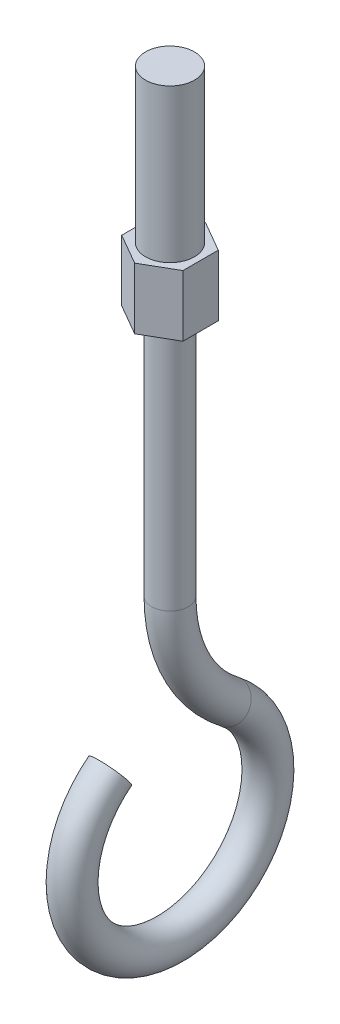
ISO-10303-21;
HEADER;
FILE_DESCRIPTION(('STEP AP214'),'2;1');
FILE_NAME('part.step','',(''),(''),'','','');
FILE_SCHEMA(('AUTOMOTIVE_DESIGN { 1 0 10303 214 1 1 1 1 }'));
ENDSEC;
DATA;
#1=APPLICATION_CONTEXT('core data for automotive mechanical design processes');
#2=APPLICATION_PROTOCOL_DEFINITION('international standard','automotive_design',2000,#1);
#3=PRODUCT_CONTEXT('',#1,'mechanical');
#4=PRODUCT('Part','Part','',(#3));
#5=PRODUCT_RELATED_PRODUCT_CATEGORY('part','',(#4));
#6=PRODUCT_DEFINITION_FORMATION('','',#4);
#7=PRODUCT_DEFINITION_CONTEXT('part definition',#1,'design');
#8=PRODUCT_DEFINITION('design','',#6,#7);
#9=PRODUCT_DEFINITION_SHAPE('','',#8);
#10=(LENGTH_UNIT() NAMED_UNIT(*) SI_UNIT(.MILLI.,.METRE.));
#11=(NAMED_UNIT(*) PLANE_ANGLE_UNIT() SI_UNIT($,.RADIAN.));
#12=(NAMED_UNIT(*) SI_UNIT($,.STERADIAN.) SOLID_ANGLE_UNIT());
#13=UNCERTAINTY_MEASURE_WITH_UNIT(LENGTH_MEASURE(1.E-05),#10,'distance_accuracy_value','');
#14=(GEOMETRIC_REPRESENTATION_CONTEXT(3) GLOBAL_UNCERTAINTY_ASSIGNED_CONTEXT((#13)) GLOBAL_UNIT_ASSIGNED_CONTEXT((#10,
#11,#12)) REPRESENTATION_CONTEXT('',''));
#15=CARTESIAN_POINT('',(0.,0.,0.));
#16=DIRECTION('',(0.,0.,1.));
#17=DIRECTION('',(1.,0.,0.));
#18=AXIS2_PLACEMENT_3D('',#15,#16,#17);
#19=CARTESIAN_POINT('',(0.,-75.9647043265553,12.390243902439));
#20=DIRECTION('',(0.,-0.609756097560976,0.792589112647411));
#21=DIRECTION('',(0.,-0.79258911264741,-0.609756097560977));
#22=AXIS2_PLACEMENT_3D('',#19,#20,#21);
#23=PLANE('',#22);
#24=CARTESIAN_POINT('',(0.,-75.9647043265553,12.390243902439));
#25=DIRECTION('',(0.,-0.609756097560976,0.792589112647411));
#26=DIRECTION('',(0.,-0.79258911264741,-0.609756097560977));
#27=AXIS2_PLACEMENT_3D('',#24,#25,#26);
#28=CIRCLE('',#27,3.81);
#29=CARTESIAN_POINT('',(0.,-78.984468845742,10.0670731707316));
#30=VERTEX_POINT('',#29);
#31=EDGE_CURVE('E10',#30,#30,#28,.T.);
#32=ORIENTED_EDGE('',*,*,#31,.F.);
#33=EDGE_LOOP('',(#32));
#34=FACE_BOUND('',#33,.T.);
#35=ADVANCED_FACE('F15',(#34),#23,.F.);
#36=CARTESIAN_POINT('',(0.,0.,0.));
#37=DIRECTION('',(0.,-1.,0.));
#38=DIRECTION('',(0.,0.,-1.));
#39=AXIS2_PLACEMENT_3D('',#36,#37,#38);
#40=CYLINDRICAL_SURFACE('',#39,3.81);
#41=CARTESIAN_POINT('',(0.,-50.8,0.));
#42=DIRECTION('',(0.,1.,0.));
#43=DIRECTION('',(0.,0.,1.));
#44=AXIS2_PLACEMENT_3D('',#41,#42,#43);
#45=CIRCLE('',#44,3.81);
#46=CARTESIAN_POINT('',(0.,-50.8,3.80999999999992));
#47=VERTEX_POINT('',#46);
#48=EDGE_CURVE('E167',#47,#47,#45,.T.);
#49=ORIENTED_EDGE('',*,*,#48,.T.);
#50=EDGE_LOOP('',(#49));
#51=FACE_BOUND('',#50,.T.);
#52=CARTESIAN_POINT('',(0.,0.,0.));
#53=DIRECTION('',(0.,1.,0.));
#54=DIRECTION('',(0.,0.,1.));
#55=AXIS2_PLACEMENT_3D('',#52,#53,#54);
#56=CIRCLE('',#55,3.81);
#57=CARTESIAN_POINT('',(0.,0.,3.81000000000001));
#58=VERTEX_POINT('',#57);
#59=EDGE_CURVE('E163',#58,#58,#56,.T.);
#60=ORIENTED_EDGE('',*,*,#59,.F.);
#61=EDGE_LOOP('',(#60));
#62=FACE_BOUND('',#61,.T.);
#63=ADVANCED_FACE('F191',(#51,#62),#40,.T.);
#64=CARTESIAN_POINT('',(0.,-50.8,-31.7500000000001));
#65=DIRECTION('',(1.,0.,0.));
#66=DIRECTION('',(0.,0.,-1.));
#67=AXIS2_PLACEMENT_3D('',#64,#65,#66);
#68=TOROIDAL_SURFACE('',#67,31.75,3.81);
#69=CARTESIAN_POINT('',(0.,-75.9647043265553,-12.390243902439));
#70=DIRECTION('',(0.,0.609756097560976,0.792589112647411));
#71=DIRECTION('',(0.,-0.792589112647411,0.609756097560977));
#72=AXIS2_PLACEMENT_3D('',#69,#70,#71);
#73=CIRCLE('',#72,3.81);
#74=CARTESIAN_POINT('',(0.,-78.9844688457419,-10.0670731707317));
#75=VERTEX_POINT('',#74);
#76=EDGE_CURVE('E24',#75,#75,#73,.T.);
#77=CARTESIAN_POINT('',(0.,-50.8,-31.7500000000001));
#78=DIRECTION('',(1.,0.,0.));
#79=DIRECTION('',(0.,0.,-1.));
#80=AXIS2_PLACEMENT_3D('',#77,#78,#79);
#81=CIRCLE('',#80,35.56);
#82=EDGE_CURVE('',#47,#75,#81,.T.);
#83=ORIENTED_EDGE('',*,*,#48,.F.);
#84=ORIENTED_EDGE('',*,*,#76,.T.);
#85=ORIENTED_EDGE('',*,*,#82,.T.);
#86=ORIENTED_EDGE('',*,*,#82,.F.);
#87=EDGE_LOOP('',(#83,#85,#84,#86));
#88=FACE_BOUND('',#87,.T.);
#89=ADVANCED_FACE('F177',(#88),#68,.T.);
#90=CARTESIAN_POINT('',(0.,-92.0701150955507,0.));
#91=DIRECTION('',(-1.,0.,0.));
#92=DIRECTION('',(0.,0.,1.));
#93=AXIS2_PLACEMENT_3D('',#90,#91,#92);
#94=TOROIDAL_SURFACE('',#93,20.32,3.81);
#95=ORIENTED_EDGE('',*,*,#31,.T.);
#96=EDGE_LOOP('',(#95));
#97=FACE_BOUND('',#96,.T.);
#98=ORIENTED_EDGE('',*,*,#76,.F.);
#99=EDGE_LOOP('',(#98));
#100=FACE_BOUND('',#99,.T.);
#101=ADVANCED_FACE('F180',(#97,#100),#94,.T.);
#102=CARTESIAN_POINT('',(0.,0.,0.));
#103=DIRECTION('',(0.,1.,0.));
#104=DIRECTION('',(0.,0.,1.));
#105=AXIS2_PLACEMENT_3D('',#102,#103,#104);
#106=PLANE('',#105);
#107=ORIENTED_EDGE('',*,*,#59,.T.);
#108=EDGE_LOOP('',(#107));
#109=FACE_BOUND('',#108,.T.);
#110=DIRECTION('',(0.,0.,-1.));
#111=VECTOR('',#110,1.);
#112=CARTESIAN_POINT('',(6.34999999999999,0.,3.66617420935411));
#113=LINE('',#112,#111);
#114=CARTESIAN_POINT('',(6.34999999999999,0.,3.66617420935411));
#115=VERTEX_POINT('',#114);
#116=CARTESIAN_POINT('',(6.34999999999999,0.,-3.66617420935418));
#117=VERTEX_POINT('',#116);
#118=EDGE_CURVE('E128',#115,#117,#113,.T.);
#119=ORIENTED_EDGE('',*,*,#118,.F.);
#120=DIRECTION('',(0.86602540378444,0.,-0.500000000000001));
#121=VECTOR('',#120,1.);
#122=CARTESIAN_POINT('',(0.,0.,7.33234841870825));
#123=LINE('',#122,#121);
#124=CARTESIAN_POINT('',(0.,0.,7.33234841870825));
#125=VERTEX_POINT('',#124);
#126=EDGE_CURVE('E75',#125,#115,#123,.T.);
#127=ORIENTED_EDGE('',*,*,#126,.F.);
#128=DIRECTION('',(0.866025403784439,0.,0.500000000000001));
#129=VECTOR('',#128,1.);
#130=CARTESIAN_POINT('',(-6.35000000000002,0.,3.6661742093541));
#131=LINE('',#130,#129);
#132=CARTESIAN_POINT('',(-6.35000000000002,0.,3.6661742093541));
#133=VERTEX_POINT('',#132);
#134=EDGE_CURVE('E67',#133,#125,#131,.T.);
#135=ORIENTED_EDGE('',*,*,#134,.F.);
#136=DIRECTION('',(0.,0.,1.));
#137=VECTOR('',#136,1.);
#138=CARTESIAN_POINT('',(-6.35000000000002,0.,-3.66617420935414));
#139=LINE('',#138,#137);
#140=CARTESIAN_POINT('',(-6.35000000000002,0.,-3.66617420935414));
#141=VERTEX_POINT('',#140);
#142=EDGE_CURVE('E112',#141,#133,#139,.T.);
#143=ORIENTED_EDGE('',*,*,#142,.F.);
#144=DIRECTION('',(-0.86602540378444,0.,0.500000000000001));
#145=VECTOR('',#144,1.);
#146=CARTESIAN_POINT('',(0.,0.,-7.33234841870828));
#147=LINE('',#146,#145);
#148=CARTESIAN_POINT('',(0.,0.,-7.33234841870828));
#149=VERTEX_POINT('',#148);
#150=EDGE_CURVE('E136',#149,#141,#147,.T.);
#151=ORIENTED_EDGE('',*,*,#150,.F.);
#152=DIRECTION('',(-0.86602540378444,0.,-0.500000000000001));
#153=VECTOR('',#152,1.);
#154=CARTESIAN_POINT('',(6.34999999999999,0.,-3.66617420935418));
#155=LINE('',#154,#153);
#156=EDGE_CURVE('E132',#117,#149,#155,.T.);
#157=ORIENTED_EDGE('',*,*,#156,.F.);
#158=EDGE_LOOP('',(#119,#127,#135,#143,#151,#157));
#159=FACE_BOUND('',#158,.T.);
#160=ADVANCED_FACE('F182',(#109,#159),#106,.F.);
#161=CARTESIAN_POINT('',(0.,12.7,0.));
#162=DIRECTION('',(0.,1.,0.));
#163=DIRECTION('',(0.,0.,1.));
#164=AXIS2_PLACEMENT_3D('',#161,#162,#163);
#165=PLANE('',#164);
#166=DIRECTION('',(0.,0.,-1.));
#167=VECTOR('',#166,1.);
#168=CARTESIAN_POINT('',(6.34999999999999,12.7,3.66617420935411));
#169=LINE('',#168,#167);
#170=CARTESIAN_POINT('',(6.34999999999999,12.7,3.66617420935411));
#171=VERTEX_POINT('',#170);
#172=CARTESIAN_POINT('',(6.34999999999999,12.7,-3.66617420935418));
#173=VERTEX_POINT('',#172);
#174=EDGE_CURVE('E145',#171,#173,#169,.T.);
#175=ORIENTED_EDGE('',*,*,#174,.T.);
#176=DIRECTION('',(-0.86602540378444,0.,-0.500000000000001));
#177=VECTOR('',#176,1.);
#178=CARTESIAN_POINT('',(6.34999999999999,12.7,-3.66617420935418));
#179=LINE('',#178,#177);
#180=CARTESIAN_POINT('',(0.,12.7,-7.33234841870833));
#181=VERTEX_POINT('',#180);
#182=EDGE_CURVE('E86',#173,#181,#179,.T.);
#183=ORIENTED_EDGE('',*,*,#182,.T.);
#184=DIRECTION('',(-0.86602540378444,0.,0.500000000000001));
#185=VECTOR('',#184,1.);
#186=CARTESIAN_POINT('',(0.,12.7,-7.33234841870833));
#187=LINE('',#186,#185);
#188=CARTESIAN_POINT('',(-6.34999999999999,12.7,-3.66617420935414));
#189=VERTEX_POINT('',#188);
#190=EDGE_CURVE('E103',#181,#189,#187,.T.);
#191=ORIENTED_EDGE('',*,*,#190,.T.);
#192=DIRECTION('',(0.,0.,1.));
#193=VECTOR('',#192,1.);
#194=CARTESIAN_POINT('',(-6.34999999999999,12.7,-3.66617420935414));
#195=LINE('',#194,#193);
#196=CARTESIAN_POINT('',(-6.35000000000002,12.7,3.6661742093541));
#197=VERTEX_POINT('',#196);
#198=EDGE_CURVE('E96',#189,#197,#195,.T.);
#199=ORIENTED_EDGE('',*,*,#198,.T.);
#200=DIRECTION('',(0.866025403784439,0.,0.500000000000001));
#201=VECTOR('',#200,1.);
#202=CARTESIAN_POINT('',(-6.35000000000002,12.7,3.6661742093541));
#203=LINE('',#202,#201);
#204=CARTESIAN_POINT('',(0.,12.7,7.33234841870825));
#205=VERTEX_POINT('',#204);
#206=EDGE_CURVE('E101',#197,#205,#203,.T.);
#207=ORIENTED_EDGE('',*,*,#206,.T.);
#208=DIRECTION('',(0.86602540378444,0.,-0.500000000000001));
#209=VECTOR('',#208,1.);
#210=CARTESIAN_POINT('',(0.,12.7,7.33234841870825));
#211=LINE('',#210,#209);
#212=EDGE_CURVE('E37',#205,#171,#211,.T.);
#213=ORIENTED_EDGE('',*,*,#212,.T.);
#214=EDGE_LOOP('',(#175,#183,#191,#199,#207,#213));
#215=FACE_BOUND('',#214,.T.);
#216=CARTESIAN_POINT('',(0.,12.7,0.));
#217=DIRECTION('',(0.,1.,0.));
#218=DIRECTION('',(0.,0.,1.));
#219=AXIS2_PLACEMENT_3D('',#216,#217,#218);
#220=CIRCLE('',#219,5.08);
#221=CARTESIAN_POINT('',(0.,12.7,5.08000000000001));
#222=VERTEX_POINT('',#221);
#223=EDGE_CURVE('E133',#222,#222,#220,.T.);
#224=ORIENTED_EDGE('',*,*,#223,.F.);
#225=EDGE_LOOP('',(#224));
#226=FACE_BOUND('',#225,.T.);
#227=ADVANCED_FACE('F98',(#215,#226),#165,.T.);
#228=CARTESIAN_POINT('',(6.34999999999999,12.7,3.66617420935411));
#229=DIRECTION('',(-1.,0.,0.));
#230=DIRECTION('',(0.,0.,1.));
#231=AXIS2_PLACEMENT_3D('',#228,#229,#230);
#232=PLANE('',#231);
#233=ORIENTED_EDGE('',*,*,#118,.T.);
#234=DIRECTION('',(0.,-1.,0.));
#235=VECTOR('',#234,1.);
#236=CARTESIAN_POINT('',(6.34999999999999,12.7,-3.66617420935418));
#237=LINE('',#236,#235);
#238=EDGE_CURVE('E156',#173,#117,#237,.T.);
#239=ORIENTED_EDGE('',*,*,#238,.F.);
#240=ORIENTED_EDGE('',*,*,#174,.F.);
#241=DIRECTION('',(0.,-1.,0.));
#242=VECTOR('',#241,1.);
#243=CARTESIAN_POINT('',(6.34999999999999,12.7,3.66617420935411));
#244=LINE('',#243,#242);
#245=EDGE_CURVE('E124',#171,#115,#244,.T.);
#246=ORIENTED_EDGE('',*,*,#245,.T.);
#247=EDGE_LOOP('',(#233,#239,#240,#246));
#248=FACE_BOUND('',#247,.T.);
#249=ADVANCED_FACE('F206',(#248),#232,.F.);
#250=CARTESIAN_POINT('',(6.34999999999999,12.7,-3.66617420935418));
#251=DIRECTION('',(-0.500000000000001,0.,0.86602540378444));
#252=DIRECTION('',(0.86602540378444,0.,0.500000000000001));
#253=AXIS2_PLACEMENT_3D('',#250,#251,#252);
#254=PLANE('',#253);
#255=ORIENTED_EDGE('',*,*,#156,.T.);
#256=DIRECTION('',(0.,-1.,0.));
#257=VECTOR('',#256,1.);
#258=CARTESIAN_POINT('',(0.,12.7,-7.33234841870833));
#259=LINE('',#258,#257);
#260=EDGE_CURVE('E152',#181,#149,#259,.T.);
#261=ORIENTED_EDGE('',*,*,#260,.F.);
#262=ORIENTED_EDGE('',*,*,#182,.F.);
#263=ORIENTED_EDGE('',*,*,#238,.T.);
#264=EDGE_LOOP('',(#255,#261,#262,#263));
#265=FACE_BOUND('',#264,.T.);
#266=ADVANCED_FACE('F209',(#265),#254,.F.);
#267=CARTESIAN_POINT('',(0.,12.7,-7.33234841870833));
#268=DIRECTION('',(0.500000000000001,0.,0.86602540378444));
#269=DIRECTION('',(0.86602540378444,0.,-0.500000000000001));
#270=AXIS2_PLACEMENT_3D('',#267,#268,#269);
#271=PLANE('',#270);
#272=ORIENTED_EDGE('',*,*,#150,.T.);
#273=DIRECTION('',(0.,-1.,0.));
#274=VECTOR('',#273,1.);
#275=CARTESIAN_POINT('',(-6.34999999999999,12.7,-3.66617420935414));
#276=LINE('',#275,#274);
#277=EDGE_CURVE('E114',#189,#141,#276,.T.);
#278=ORIENTED_EDGE('',*,*,#277,.F.);
#279=ORIENTED_EDGE('',*,*,#190,.F.);
#280=ORIENTED_EDGE('',*,*,#260,.T.);
#281=EDGE_LOOP('',(#272,#278,#279,#280));
#282=FACE_BOUND('',#281,.T.);
#283=ADVANCED_FACE('F213',(#282),#271,.F.);
#284=CARTESIAN_POINT('',(-6.34999999999999,12.7,-3.66617420935414));
#285=DIRECTION('',(1.,0.,0.));
#286=DIRECTION('',(0.,0.,-1.));
#287=AXIS2_PLACEMENT_3D('',#284,#285,#286);
#288=PLANE('',#287);
#289=ORIENTED_EDGE('',*,*,#142,.T.);
#290=DIRECTION('',(0.,-1.,0.));
#291=VECTOR('',#290,1.);
#292=CARTESIAN_POINT('',(-6.35000000000002,12.7,3.6661742093541));
#293=LINE('',#292,#291);
#294=EDGE_CURVE('E109',#197,#133,#293,.T.);
#295=ORIENTED_EDGE('',*,*,#294,.F.);
#296=ORIENTED_EDGE('',*,*,#198,.F.);
#297=ORIENTED_EDGE('',*,*,#277,.T.);
#298=EDGE_LOOP('',(#289,#295,#296,#297));
#299=FACE_BOUND('',#298,.T.);
#300=ADVANCED_FACE('F110',(#299),#288,.F.);
#301=CARTESIAN_POINT('',(-6.35000000000002,12.7,3.6661742093541));
#302=DIRECTION('',(0.500000000000001,0.,-0.866025403784439));
#303=DIRECTION('',(-0.86602540378444,0.,-0.500000000000001));
#304=AXIS2_PLACEMENT_3D('',#301,#302,#303);
#305=PLANE('',#304);
#306=ORIENTED_EDGE('',*,*,#134,.T.);
#307=DIRECTION('',(0.,-1.,0.));
#308=VECTOR('',#307,1.);
#309=CARTESIAN_POINT('',(0.,12.7,7.33234841870825));
#310=LINE('',#309,#308);
#311=EDGE_CURVE('E115',#205,#125,#310,.T.);
#312=ORIENTED_EDGE('',*,*,#311,.F.);
#313=ORIENTED_EDGE('',*,*,#206,.F.);
#314=ORIENTED_EDGE('',*,*,#294,.T.);
#315=EDGE_LOOP('',(#306,#312,#313,#314));
#316=FACE_BOUND('',#315,.T.);
#317=ADVANCED_FACE('F117',(#316),#305,.F.);
#318=CARTESIAN_POINT('',(0.,12.7,7.33234841870825));
#319=DIRECTION('',(-0.500000000000001,0.,-0.86602540378444));
#320=DIRECTION('',(-0.86602540378444,0.,0.500000000000001));
#321=AXIS2_PLACEMENT_3D('',#318,#319,#320);
#322=PLANE('',#321);
#323=ORIENTED_EDGE('',*,*,#126,.T.);
#324=ORIENTED_EDGE('',*,*,#245,.F.);
#325=ORIENTED_EDGE('',*,*,#212,.F.);
#326=ORIENTED_EDGE('',*,*,#311,.T.);
#327=EDGE_LOOP('',(#323,#324,#325,#326));
#328=FACE_BOUND('',#327,.T.);
#329=ADVANCED_FACE('F201',(#328),#322,.F.);
#330=CARTESIAN_POINT('',(0.,44.45,0.));
#331=DIRECTION('',(0.,1.,0.));
#332=DIRECTION('',(0.,0.,1.));
#333=AXIS2_PLACEMENT_3D('',#330,#331,#332);
#334=PLANE('',#333);
#335=CARTESIAN_POINT('',(0.,44.45,0.));
#336=DIRECTION('',(0.,1.,0.));
#337=DIRECTION('',(0.,0.,1.));
#338=AXIS2_PLACEMENT_3D('',#335,#336,#337);
#339=CIRCLE('',#338,5.08);
#340=CARTESIAN_POINT('',(0.,44.45,5.08000000000001));
#341=VERTEX_POINT('',#340);
#342=EDGE_CURVE('E159',#341,#341,#339,.T.);
#343=ORIENTED_EDGE('',*,*,#342,.T.);
#344=EDGE_LOOP('',(#343));
#345=FACE_BOUND('',#344,.T.);
#346=ADVANCED_FACE('F197',(#345),#334,.T.);
#347=CARTESIAN_POINT('',(0.,90.5684097937106,0.));
#348=DIRECTION('',(0.,-1.,0.));
#349=DIRECTION('',(0.,0.,-1.));
#350=AXIS2_PLACEMENT_3D('',#347,#348,#349);
#351=CYLINDRICAL_SURFACE('',#350,5.08);
#352=ORIENTED_EDGE('',*,*,#223,.T.);
#353=EDGE_LOOP('',(#352));
#354=FACE_BOUND('',#353,.T.);
#355=ORIENTED_EDGE('',*,*,#342,.F.);
#356=EDGE_LOOP('',(#355));
#357=FACE_BOUND('',#356,.T.);
#358=ADVANCED_FACE('F200',(#354,#357),#351,.T.);
#359=CLOSED_SHELL('',(#35,#63,#89,#101,#160,#227,#249,#266,#283,#300,#317,#329,#346,#358));
#360=MANIFOLD_SOLID_BREP('B1',#359);
#361=ADVANCED_BREP_SHAPE_REPRESENTATION('',(#18,#360),#14);
#362=SHAPE_DEFINITION_REPRESENTATION(#9,#361);
ENDSEC;
END-ISO-10303-21;
